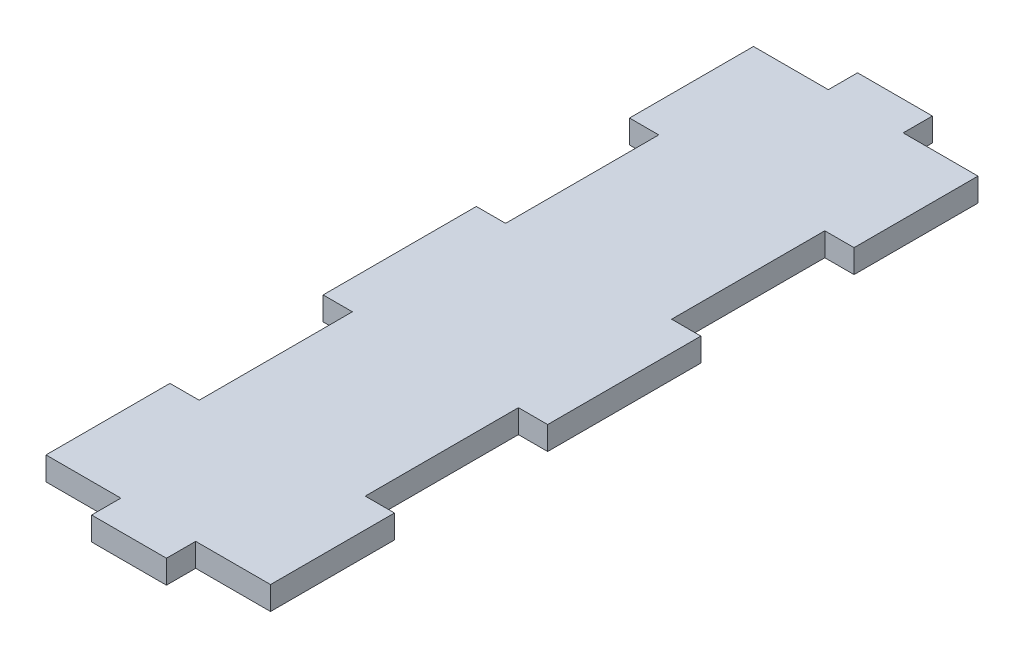
ISO-10303-21;
HEADER;
FILE_DESCRIPTION(('STEP AP214'),'2;1');
FILE_NAME('part.step','',(''),(''),'','','');
FILE_SCHEMA(('AUTOMOTIVE_DESIGN { 1 0 10303 214 1 1 1 1 }'));
ENDSEC;
DATA;
#1=APPLICATION_CONTEXT('core data for automotive mechanical design processes');
#2=APPLICATION_PROTOCOL_DEFINITION('international standard','automotive_design',2000,#1);
#3=PRODUCT_CONTEXT('',#1,'mechanical');
#4=PRODUCT('Part','Part','',(#3));
#5=PRODUCT_RELATED_PRODUCT_CATEGORY('part','',(#4));
#6=PRODUCT_DEFINITION_FORMATION('','',#4);
#7=PRODUCT_DEFINITION_CONTEXT('part definition',#1,'design');
#8=PRODUCT_DEFINITION('design','',#6,#7);
#9=PRODUCT_DEFINITION_SHAPE('','',#8);
#10=(LENGTH_UNIT() NAMED_UNIT(*) SI_UNIT(.MILLI.,.METRE.));
#11=(NAMED_UNIT(*) PLANE_ANGLE_UNIT() SI_UNIT($,.RADIAN.));
#12=(NAMED_UNIT(*) SI_UNIT($,.STERADIAN.) SOLID_ANGLE_UNIT());
#13=UNCERTAINTY_MEASURE_WITH_UNIT(LENGTH_MEASURE(1.E-05),#10,'distance_accuracy_value','');
#14=(GEOMETRIC_REPRESENTATION_CONTEXT(3) GLOBAL_UNCERTAINTY_ASSIGNED_CONTEXT((#13)) GLOBAL_UNIT_ASSIGNED_CONTEXT((#10,
#11,#12)) REPRESENTATION_CONTEXT('',''));
#15=CARTESIAN_POINT('',(0.,0.,0.));
#16=DIRECTION('',(0.,0.,1.));
#17=DIRECTION('',(1.,0.,0.));
#18=AXIS2_PLACEMENT_3D('',#15,#16,#17);
#19=CARTESIAN_POINT('',(12.192,2.54,41.5925));
#20=DIRECTION('',(-1.,0.,0.));
#21=DIRECTION('',(0.,0.,1.));
#22=AXIS2_PLACEMENT_3D('',#19,#20,#21);
#23=PLANE('',#22);
#24=DIRECTION('',(0.,0.,-1.));
#25=VECTOR('',#24,1.);
#26=CARTESIAN_POINT('',(12.192,2.54,41.5925));
#27=LINE('',#26,#25);
#28=CARTESIAN_POINT('',(12.192,2.54,38.4175));
#29=VERTEX_POINT('',#28);
#30=CARTESIAN_POINT('',(12.192,2.54,24.9555));
#31=VERTEX_POINT('',#30);
#32=EDGE_CURVE('E251',#29,#31,#27,.T.);
#33=ORIENTED_EDGE('',*,*,#32,.F.);
#34=DIRECTION('',(0.,1.,0.));
#35=VECTOR('',#34,1.);
#36=CARTESIAN_POINT('',(12.192,-0.635,38.4175));
#37=LINE('',#36,#35);
#38=CARTESIAN_POINT('',(12.192,0.,38.4175));
#39=VERTEX_POINT('',#38);
#40=EDGE_CURVE('E364',#39,#29,#37,.T.);
#41=ORIENTED_EDGE('',*,*,#40,.F.);
#42=DIRECTION('',(0.,0.,-1.));
#43=VECTOR('',#42,1.);
#44=CARTESIAN_POINT('',(12.192,0.,41.5925));
#45=LINE('',#44,#43);
#46=CARTESIAN_POINT('',(12.192,0.,24.9555));
#47=VERTEX_POINT('',#46);
#48=EDGE_CURVE('E413',#39,#47,#45,.T.);
#49=ORIENTED_EDGE('',*,*,#48,.T.);
#50=DIRECTION('',(0.,1.,0.));
#51=VECTOR('',#50,1.);
#52=CARTESIAN_POINT('',(12.192,0.,24.9555));
#53=LINE('',#52,#51);
#54=EDGE_CURVE('E318',#47,#31,#53,.T.);
#55=ORIENTED_EDGE('',*,*,#54,.T.);
#56=EDGE_LOOP('',(#33,#41,#49,#55));
#57=FACE_BOUND('',#56,.T.);
#58=ADVANCED_FACE('F33',(#57),#23,.F.);
#59=CARTESIAN_POINT('',(-12.192,2.54,41.5925));
#60=DIRECTION('',(1.,0.,0.));
#61=DIRECTION('',(0.,0.,-1.));
#62=AXIS2_PLACEMENT_3D('',#59,#60,#61);
#63=PLANE('',#62);
#64=DIRECTION('',(0.,0.,1.));
#65=VECTOR('',#64,1.);
#66=CARTESIAN_POINT('',(-12.192,0.,41.5925));
#67=LINE('',#66,#65);
#68=CARTESIAN_POINT('',(-12.192,0.,24.9555));
#69=VERTEX_POINT('',#68);
#70=CARTESIAN_POINT('',(-12.192,0.,38.4175));
#71=VERTEX_POINT('',#70);
#72=EDGE_CURVE('E412',#69,#71,#67,.T.);
#73=ORIENTED_EDGE('',*,*,#72,.T.);
#74=DIRECTION('',(0.,1.,0.));
#75=VECTOR('',#74,1.);
#76=CARTESIAN_POINT('',(-12.192,-0.635,38.4175));
#77=LINE('',#76,#75);
#78=CARTESIAN_POINT('',(-12.192,2.54,38.4175));
#79=VERTEX_POINT('',#78);
#80=EDGE_CURVE('E55',#71,#79,#77,.T.);
#81=ORIENTED_EDGE('',*,*,#80,.T.);
#82=DIRECTION('',(0.,0.,1.));
#83=VECTOR('',#82,1.);
#84=CARTESIAN_POINT('',(-12.192,2.54,41.5925));
#85=LINE('',#84,#83);
#86=CARTESIAN_POINT('',(-12.192,2.54,24.9555));
#87=VERTEX_POINT('',#86);
#88=EDGE_CURVE('E241',#87,#79,#85,.T.);
#89=ORIENTED_EDGE('',*,*,#88,.F.);
#90=DIRECTION('',(0.,1.,0.));
#91=VECTOR('',#90,1.);
#92=CARTESIAN_POINT('',(-12.192,0.,24.9555));
#93=LINE('',#92,#91);
#94=EDGE_CURVE('E346',#69,#87,#93,.T.);
#95=ORIENTED_EDGE('',*,*,#94,.F.);
#96=EDGE_LOOP('',(#73,#81,#89,#95));
#97=FACE_BOUND('',#96,.T.);
#98=ADVANCED_FACE('F457',(#97),#63,.F.);
#99=CARTESIAN_POINT('',(12.192,2.54,8.3185));
#100=VERTEX_POINT('',#99);
#101=CARTESIAN_POINT('',(12.192,2.54,-8.3185));
#102=VERTEX_POINT('',#101);
#103=EDGE_CURVE('E254',#100,#102,#27,.T.);
#104=ORIENTED_EDGE('',*,*,#103,.F.);
#105=DIRECTION('',(0.,1.,0.));
#106=VECTOR('',#105,1.);
#107=CARTESIAN_POINT('',(12.192,0.,8.3185));
#108=LINE('',#107,#106);
#109=CARTESIAN_POINT('',(12.192,0.,8.3185));
#110=VERTEX_POINT('',#109);
#111=EDGE_CURVE('E311',#110,#100,#108,.T.);
#112=ORIENTED_EDGE('',*,*,#111,.F.);
#113=CARTESIAN_POINT('',(12.192,0.,-8.3185));
#114=VERTEX_POINT('',#113);
#115=EDGE_CURVE('E419',#110,#114,#45,.T.);
#116=ORIENTED_EDGE('',*,*,#115,.T.);
#117=DIRECTION('',(0.,1.,0.));
#118=VECTOR('',#117,1.);
#119=CARTESIAN_POINT('',(12.192,0.,-8.3185));
#120=LINE('',#119,#118);
#121=EDGE_CURVE('E265',#114,#102,#120,.T.);
#122=ORIENTED_EDGE('',*,*,#121,.T.);
#123=EDGE_LOOP('',(#104,#112,#116,#122));
#124=FACE_BOUND('',#123,.T.);
#125=ADVANCED_FACE('F500',(#124),#23,.F.);
#126=CARTESIAN_POINT('',(-12.192,0.,-8.3185));
#127=VERTEX_POINT('',#126);
#128=CARTESIAN_POINT('',(-12.192,0.,8.3185));
#129=VERTEX_POINT('',#128);
#130=EDGE_CURVE('E416',#127,#129,#67,.T.);
#131=ORIENTED_EDGE('',*,*,#130,.T.);
#132=DIRECTION('',(0.,1.,0.));
#133=VECTOR('',#132,1.);
#134=CARTESIAN_POINT('',(-12.192,0.,8.3185));
#135=LINE('',#134,#133);
#136=CARTESIAN_POINT('',(-12.192,2.54,8.3185));
#137=VERTEX_POINT('',#136);
#138=EDGE_CURVE('E342',#129,#137,#135,.T.);
#139=ORIENTED_EDGE('',*,*,#138,.T.);
#140=CARTESIAN_POINT('',(-12.192,2.54,-8.3185));
#141=VERTEX_POINT('',#140);
#142=EDGE_CURVE('E239',#141,#137,#85,.T.);
#143=ORIENTED_EDGE('',*,*,#142,.F.);
#144=DIRECTION('',(0.,1.,0.));
#145=VECTOR('',#144,1.);
#146=CARTESIAN_POINT('',(-12.192,0.,-8.3185));
#147=LINE('',#146,#145);
#148=EDGE_CURVE('E291',#127,#141,#147,.T.);
#149=ORIENTED_EDGE('',*,*,#148,.F.);
#150=EDGE_LOOP('',(#131,#139,#143,#149));
#151=FACE_BOUND('',#150,.T.);
#152=ADVANCED_FACE('F474',(#151),#63,.F.);
#153=CARTESIAN_POINT('',(12.192,0.,-24.9555));
#154=VERTEX_POINT('',#153);
#155=CARTESIAN_POINT('',(12.192,0.,-38.4175));
#156=VERTEX_POINT('',#155);
#157=EDGE_CURVE('E295',#154,#156,#45,.T.);
#158=ORIENTED_EDGE('',*,*,#157,.T.);
#159=DIRECTION('',(0.,1.,0.));
#160=VECTOR('',#159,1.);
#161=CARTESIAN_POINT('',(12.192,-0.635,-38.4175));
#162=LINE('',#161,#160);
#163=CARTESIAN_POINT('',(12.192,2.54,-38.4175));
#164=VERTEX_POINT('',#163);
#165=EDGE_CURVE('E381',#156,#164,#162,.T.);
#166=ORIENTED_EDGE('',*,*,#165,.T.);
#167=CARTESIAN_POINT('',(12.192,2.54,-24.9555));
#168=VERTEX_POINT('',#167);
#169=EDGE_CURVE('E256',#168,#164,#27,.T.);
#170=ORIENTED_EDGE('',*,*,#169,.F.);
#171=DIRECTION('',(0.,1.,0.));
#172=VECTOR('',#171,1.);
#173=CARTESIAN_POINT('',(12.192,0.,-24.9555));
#174=LINE('',#173,#172);
#175=EDGE_CURVE('E258',#154,#168,#174,.T.);
#176=ORIENTED_EDGE('',*,*,#175,.F.);
#177=EDGE_LOOP('',(#158,#166,#170,#176));
#178=FACE_BOUND('',#177,.T.);
#179=ADVANCED_FACE('F35',(#178),#23,.F.);
#180=CARTESIAN_POINT('',(-12.192,2.54,-41.5925));
#181=DIRECTION('',(0.,0.,1.));
#182=DIRECTION('',(1.,0.,0.));
#183=AXIS2_PLACEMENT_3D('',#180,#181,#182);
#184=PLANE('',#183);
#185=DIRECTION('',(-1.,0.,0.));
#186=VECTOR('',#185,1.);
#187=CARTESIAN_POINT('',(-12.192,0.,-41.5925));
#188=LINE('',#187,#186);
#189=CARTESIAN_POINT('',(4.064,0.,-41.5925));
#190=VERTEX_POINT('',#189);
#191=CARTESIAN_POINT('',(-4.064,0.,-41.5925));
#192=VERTEX_POINT('',#191);
#193=EDGE_CURVE('E409',#190,#192,#188,.T.);
#194=ORIENTED_EDGE('',*,*,#193,.T.);
#195=DIRECTION('',(0.,1.,0.));
#196=VECTOR('',#195,1.);
#197=CARTESIAN_POINT('',(-4.064,-0.635,-41.5925));
#198=LINE('',#197,#196);
#199=CARTESIAN_POINT('',(-4.064,2.54,-41.5925));
#200=VERTEX_POINT('',#199);
#201=EDGE_CURVE('E378',#192,#200,#198,.T.);
#202=ORIENTED_EDGE('',*,*,#201,.T.);
#203=DIRECTION('',(-1.,0.,0.));
#204=VECTOR('',#203,1.);
#205=CARTESIAN_POINT('',(-12.192,2.54,-41.5925));
#206=LINE('',#205,#204);
#207=CARTESIAN_POINT('',(4.064,2.54,-41.5925));
#208=VERTEX_POINT('',#207);
#209=EDGE_CURVE('E247',#208,#200,#206,.T.);
#210=ORIENTED_EDGE('',*,*,#209,.F.);
#211=DIRECTION('',(0.,1.,0.));
#212=VECTOR('',#211,1.);
#213=CARTESIAN_POINT('',(4.064,-0.635,-41.5925));
#214=LINE('',#213,#212);
#215=EDGE_CURVE('E332',#190,#208,#214,.T.);
#216=ORIENTED_EDGE('',*,*,#215,.F.);
#217=EDGE_LOOP('',(#194,#202,#210,#216));
#218=FACE_BOUND('',#217,.T.);
#219=ADVANCED_FACE('F406',(#218),#184,.F.);
#220=CARTESIAN_POINT('',(-12.192,2.54,-38.4175));
#221=VERTEX_POINT('',#220);
#222=CARTESIAN_POINT('',(-12.192,2.54,-24.9555));
#223=VERTEX_POINT('',#222);
#224=EDGE_CURVE('E230',#221,#223,#85,.T.);
#225=ORIENTED_EDGE('',*,*,#224,.F.);
#226=DIRECTION('',(0.,1.,0.));
#227=VECTOR('',#226,1.);
#228=CARTESIAN_POINT('',(-12.192,-0.635,-38.4175));
#229=LINE('',#228,#227);
#230=CARTESIAN_POINT('',(-12.192,0.,-38.4175));
#231=VERTEX_POINT('',#230);
#232=EDGE_CURVE('E215',#231,#221,#229,.T.);
#233=ORIENTED_EDGE('',*,*,#232,.F.);
#234=CARTESIAN_POINT('',(-12.192,0.,-24.9555));
#235=VERTEX_POINT('',#234);
#236=EDGE_CURVE('E418',#231,#235,#67,.T.);
#237=ORIENTED_EDGE('',*,*,#236,.T.);
#238=DIRECTION('',(0.,1.,0.));
#239=VECTOR('',#238,1.);
#240=CARTESIAN_POINT('',(-12.192,0.,-24.9555));
#241=LINE('',#240,#239);
#242=EDGE_CURVE('E237',#235,#223,#241,.T.);
#243=ORIENTED_EDGE('',*,*,#242,.T.);
#244=EDGE_LOOP('',(#225,#233,#237,#243));
#245=FACE_BOUND('',#244,.T.);
#246=ADVANCED_FACE('F235',(#245),#63,.F.);
#247=CARTESIAN_POINT('',(-12.192,2.54,41.5925));
#248=DIRECTION('',(0.,0.,-1.));
#249=DIRECTION('',(-1.,0.,0.));
#250=AXIS2_PLACEMENT_3D('',#247,#248,#249);
#251=PLANE('',#250);
#252=DIRECTION('',(1.,0.,0.));
#253=VECTOR('',#252,1.);
#254=CARTESIAN_POINT('',(-12.192,2.54,41.5925));
#255=LINE('',#254,#253);
#256=CARTESIAN_POINT('',(-4.064,2.54,41.5925));
#257=VERTEX_POINT('',#256);
#258=CARTESIAN_POINT('',(4.064,2.54,41.5925));
#259=VERTEX_POINT('',#258);
#260=EDGE_CURVE('E238',#257,#259,#255,.T.);
#261=ORIENTED_EDGE('',*,*,#260,.F.);
#262=DIRECTION('',(0.,1.,0.));
#263=VECTOR('',#262,1.);
#264=CARTESIAN_POINT('',(-4.064,-0.635,41.5925));
#265=LINE('',#264,#263);
#266=CARTESIAN_POINT('',(-4.064,0.,41.5925));
#267=VERTEX_POINT('',#266);
#268=EDGE_CURVE('E232',#267,#257,#265,.T.);
#269=ORIENTED_EDGE('',*,*,#268,.F.);
#270=DIRECTION('',(1.,0.,0.));
#271=VECTOR('',#270,1.);
#272=CARTESIAN_POINT('',(-12.192,0.,41.5925));
#273=LINE('',#272,#271);
#274=CARTESIAN_POINT('',(4.064,0.,41.5925));
#275=VERTEX_POINT('',#274);
#276=EDGE_CURVE('E422',#267,#275,#273,.T.);
#277=ORIENTED_EDGE('',*,*,#276,.T.);
#278=DIRECTION('',(0.,1.,0.));
#279=VECTOR('',#278,1.);
#280=CARTESIAN_POINT('',(4.064,-0.635,41.5925));
#281=LINE('',#280,#279);
#282=EDGE_CURVE('E369',#275,#259,#281,.T.);
#283=ORIENTED_EDGE('',*,*,#282,.T.);
#284=EDGE_LOOP('',(#261,#269,#277,#283));
#285=FACE_BOUND('',#284,.T.);
#286=ADVANCED_FACE('F444',(#285),#251,.F.);
#287=CARTESIAN_POINT('',(0.,2.54,0.));
#288=DIRECTION('',(0.,-1.,0.));
#289=DIRECTION('',(0.,0.,-1.));
#290=AXIS2_PLACEMENT_3D('',#287,#288,#289);
#291=PLANE('',#290);
#292=ORIENTED_EDGE('',*,*,#209,.T.);
#293=DIRECTION('',(0.,0.,-1.));
#294=VECTOR('',#293,1.);
#295=CARTESIAN_POINT('',(-4.064,2.54,-38.4175));
#296=LINE('',#295,#294);
#297=CARTESIAN_POINT('',(-4.064,2.54,-38.4175));
#298=VERTEX_POINT('',#297);
#299=EDGE_CURVE('E224',#298,#200,#296,.T.);
#300=ORIENTED_EDGE('',*,*,#299,.F.);
#301=DIRECTION('',(1.,0.,0.));
#302=VECTOR('',#301,1.);
#303=CARTESIAN_POINT('',(-12.192,2.54,-38.4175));
#304=LINE('',#303,#302);
#305=EDGE_CURVE('E218',#221,#298,#304,.T.);
#306=ORIENTED_EDGE('',*,*,#305,.F.);
#307=ORIENTED_EDGE('',*,*,#224,.T.);
#308=DIRECTION('',(-1.,0.,0.));
#309=VECTOR('',#308,1.);
#310=CARTESIAN_POINT('',(-9.01700000000001,2.54,-24.9555));
#311=LINE('',#310,#309);
#312=CARTESIAN_POINT('',(-9.01700000000001,2.54,-24.9555));
#313=VERTEX_POINT('',#312);
#314=EDGE_CURVE('E300',#313,#223,#311,.T.);
#315=ORIENTED_EDGE('',*,*,#314,.F.);
#316=DIRECTION('',(0.,0.,-1.));
#317=VECTOR('',#316,1.);
#318=CARTESIAN_POINT('',(-9.01700000000001,2.54,-8.3185));
#319=LINE('',#318,#317);
#320=CARTESIAN_POINT('',(-9.01700000000001,2.54,-8.3185));
#321=VERTEX_POINT('',#320);
#322=EDGE_CURVE('E268',#321,#313,#319,.T.);
#323=ORIENTED_EDGE('',*,*,#322,.F.);
#324=DIRECTION('',(1.,0.,0.));
#325=VECTOR('',#324,1.);
#326=CARTESIAN_POINT('',(-9.01700000000001,2.54,-8.3185));
#327=LINE('',#326,#325);
#328=EDGE_CURVE('E296',#141,#321,#327,.T.);
#329=ORIENTED_EDGE('',*,*,#328,.F.);
#330=ORIENTED_EDGE('',*,*,#142,.T.);
#331=DIRECTION('',(-1.,0.,0.));
#332=VECTOR('',#331,1.);
#333=CARTESIAN_POINT('',(-9.01700000000001,2.54,8.3185));
#334=LINE('',#333,#332);
#335=CARTESIAN_POINT('',(-9.01700000000001,2.54,8.3185));
#336=VERTEX_POINT('',#335);
#337=EDGE_CURVE('E353',#336,#137,#334,.T.);
#338=ORIENTED_EDGE('',*,*,#337,.F.);
#339=DIRECTION('',(0.,0.,-1.));
#340=VECTOR('',#339,1.);
#341=CARTESIAN_POINT('',(-9.01700000000001,2.54,24.9555));
#342=LINE('',#341,#340);
#343=CARTESIAN_POINT('',(-9.01700000000001,2.54,24.9555));
#344=VERTEX_POINT('',#343);
#345=EDGE_CURVE('E321',#344,#336,#342,.T.);
#346=ORIENTED_EDGE('',*,*,#345,.F.);
#347=DIRECTION('',(1.,0.,0.));
#348=VECTOR('',#347,1.);
#349=CARTESIAN_POINT('',(-9.01700000000001,2.54,24.9555));
#350=LINE('',#349,#348);
#351=EDGE_CURVE('E349',#87,#344,#350,.T.);
#352=ORIENTED_EDGE('',*,*,#351,.F.);
#353=ORIENTED_EDGE('',*,*,#88,.T.);
#354=DIRECTION('',(-1.,0.,0.));
#355=VECTOR('',#354,1.);
#356=CARTESIAN_POINT('',(-4.064,2.54,38.4175));
#357=LINE('',#356,#355);
#358=CARTESIAN_POINT('',(-4.064,2.54,38.4175));
#359=VERTEX_POINT('',#358);
#360=EDGE_CURVE('E391',#359,#79,#357,.T.);
#361=ORIENTED_EDGE('',*,*,#360,.F.);
#362=DIRECTION('',(0.,0.,-1.));
#363=VECTOR('',#362,1.);
#364=CARTESIAN_POINT('',(-4.064,2.54,41.5925));
#365=LINE('',#364,#363);
#366=EDGE_CURVE('E395',#257,#359,#365,.T.);
#367=ORIENTED_EDGE('',*,*,#366,.F.);
#368=ORIENTED_EDGE('',*,*,#260,.T.);
#369=DIRECTION('',(0.,0.,1.));
#370=VECTOR('',#369,1.);
#371=CARTESIAN_POINT('',(4.064,2.54,41.5925));
#372=LINE('',#371,#370);
#373=CARTESIAN_POINT('',(4.064,2.54,38.4175));
#374=VERTEX_POINT('',#373);
#375=EDGE_CURVE('E367',#374,#259,#372,.T.);
#376=ORIENTED_EDGE('',*,*,#375,.F.);
#377=DIRECTION('',(-1.,0.,0.));
#378=VECTOR('',#377,1.);
#379=CARTESIAN_POINT('',(12.192,2.54,38.4175));
#380=LINE('',#379,#378);
#381=EDGE_CURVE('E375',#29,#374,#380,.T.);
#382=ORIENTED_EDGE('',*,*,#381,.F.);
#383=ORIENTED_EDGE('',*,*,#32,.T.);
#384=DIRECTION('',(1.,0.,0.));
#385=VECTOR('',#384,1.);
#386=CARTESIAN_POINT('',(12.192,2.54,24.9555));
#387=LINE('',#386,#385);
#388=CARTESIAN_POINT('',(9.017,2.54,24.9555));
#389=VERTEX_POINT('',#388);
#390=EDGE_CURVE('E322',#389,#31,#387,.T.);
#391=ORIENTED_EDGE('',*,*,#390,.F.);
#392=DIRECTION('',(0.,0.,1.));
#393=VECTOR('',#392,1.);
#394=CARTESIAN_POINT('',(9.017,2.54,24.9555));
#395=LINE('',#394,#393);
#396=CARTESIAN_POINT('',(9.017,2.54,8.3185));
#397=VERTEX_POINT('',#396);
#398=EDGE_CURVE('E326',#397,#389,#395,.T.);
#399=ORIENTED_EDGE('',*,*,#398,.F.);
#400=DIRECTION('',(-1.,0.,0.));
#401=VECTOR('',#400,1.);
#402=CARTESIAN_POINT('',(12.192,2.54,8.3185));
#403=LINE('',#402,#401);
#404=EDGE_CURVE('E329',#100,#397,#403,.T.);
#405=ORIENTED_EDGE('',*,*,#404,.F.);
#406=ORIENTED_EDGE('',*,*,#103,.T.);
#407=DIRECTION('',(1.,0.,0.));
#408=VECTOR('',#407,1.);
#409=CARTESIAN_POINT('',(12.192,2.54,-8.3185));
#410=LINE('',#409,#408);
#411=CARTESIAN_POINT('',(9.017,2.54,-8.3185));
#412=VERTEX_POINT('',#411);
#413=EDGE_CURVE('E269',#412,#102,#410,.T.);
#414=ORIENTED_EDGE('',*,*,#413,.F.);
#415=DIRECTION('',(0.,0.,1.));
#416=VECTOR('',#415,1.);
#417=CARTESIAN_POINT('',(9.017,2.54,-8.3185));
#418=LINE('',#417,#416);
#419=CARTESIAN_POINT('',(9.017,2.54,-24.9555));
#420=VERTEX_POINT('',#419);
#421=EDGE_CURVE('E273',#420,#412,#418,.T.);
#422=ORIENTED_EDGE('',*,*,#421,.F.);
#423=DIRECTION('',(-1.,0.,0.));
#424=VECTOR('',#423,1.);
#425=CARTESIAN_POINT('',(12.192,2.54,-24.9555));
#426=LINE('',#425,#424);
#427=EDGE_CURVE('E276',#168,#420,#426,.T.);
#428=ORIENTED_EDGE('',*,*,#427,.F.);
#429=ORIENTED_EDGE('',*,*,#169,.T.);
#430=DIRECTION('',(1.,0.,0.));
#431=VECTOR('',#430,1.);
#432=CARTESIAN_POINT('',(4.064,2.54,-38.4175));
#433=LINE('',#432,#431);
#434=CARTESIAN_POINT('',(4.064,2.54,-38.4175));
#435=VERTEX_POINT('',#434);
#436=EDGE_CURVE('E382',#435,#164,#433,.T.);
#437=ORIENTED_EDGE('',*,*,#436,.F.);
#438=DIRECTION('',(0.,0.,1.));
#439=VECTOR('',#438,1.);
#440=CARTESIAN_POINT('',(4.064,2.54,-38.4175));
#441=LINE('',#440,#439);
#442=EDGE_CURVE('E372',#208,#435,#441,.T.);
#443=ORIENTED_EDGE('',*,*,#442,.F.);
#444=EDGE_LOOP('',(#292,#300,#306,#307,#315,#323,#329,#330,#338,#346,#352,#353,#361,#367,#368,
#376,#382,#383,#391,#399,#405,#406,#414,#422,#428,#429,#437,#443));
#445=FACE_BOUND('',#444,.T.);
#446=ADVANCED_FACE('F228',(#445),#291,.F.);
#447=CARTESIAN_POINT('',(0.,0.,0.));
#448=DIRECTION('',(0.,-1.,0.));
#449=DIRECTION('',(0.,0.,-1.));
#450=AXIS2_PLACEMENT_3D('',#447,#448,#449);
#451=PLANE('',#450);
#452=DIRECTION('',(0.,0.,1.));
#453=VECTOR('',#452,1.);
#454=CARTESIAN_POINT('',(-4.064,0.,0.));
#455=LINE('',#454,#453);
#456=CARTESIAN_POINT('',(-4.064,0.,-38.4175));
#457=VERTEX_POINT('',#456);
#458=EDGE_CURVE('E11',#192,#457,#455,.T.);
#459=ORIENTED_EDGE('',*,*,#458,.F.);
#460=ORIENTED_EDGE('',*,*,#193,.F.);
#461=DIRECTION('',(0.,0.,-1.));
#462=VECTOR('',#461,1.);
#463=CARTESIAN_POINT('',(4.064,0.,0.));
#464=LINE('',#463,#462);
#465=CARTESIAN_POINT('',(4.064,0.,-38.4175));
#466=VERTEX_POINT('',#465);
#467=EDGE_CURVE('E430',#466,#190,#464,.T.);
#468=ORIENTED_EDGE('',*,*,#467,.F.);
#469=DIRECTION('',(-1.,0.,0.));
#470=VECTOR('',#469,1.);
#471=CARTESIAN_POINT('',(0.,0.,-38.4175));
#472=LINE('',#471,#470);
#473=EDGE_CURVE('E428',#156,#466,#472,.T.);
#474=ORIENTED_EDGE('',*,*,#473,.F.);
#475=ORIENTED_EDGE('',*,*,#157,.F.);
#476=DIRECTION('',(-1.,0.,0.));
#477=VECTOR('',#476,1.);
#478=CARTESIAN_POINT('',(12.192,0.,-24.9555));
#479=LINE('',#478,#477);
#480=CARTESIAN_POINT('',(9.017,0.,-24.9555));
#481=VERTEX_POINT('',#480);
#482=EDGE_CURVE('E272',#154,#481,#479,.T.);
#483=ORIENTED_EDGE('',*,*,#482,.T.);
#484=DIRECTION('',(0.,0.,1.));
#485=VECTOR('',#484,1.);
#486=CARTESIAN_POINT('',(9.017,0.,-8.3185));
#487=LINE('',#486,#485);
#488=CARTESIAN_POINT('',(9.017,0.,-8.3185));
#489=VERTEX_POINT('',#488);
#490=EDGE_CURVE('E282',#481,#489,#487,.T.);
#491=ORIENTED_EDGE('',*,*,#490,.T.);
#492=DIRECTION('',(1.,0.,0.));
#493=VECTOR('',#492,1.);
#494=CARTESIAN_POINT('',(12.192,0.,-8.3185));
#495=LINE('',#494,#493);
#496=EDGE_CURVE('E261',#489,#114,#495,.T.);
#497=ORIENTED_EDGE('',*,*,#496,.T.);
#498=ORIENTED_EDGE('',*,*,#115,.F.);
#499=DIRECTION('',(-1.,0.,0.));
#500=VECTOR('',#499,1.);
#501=CARTESIAN_POINT('',(12.192,0.,8.3185));
#502=LINE('',#501,#500);
#503=CARTESIAN_POINT('',(9.017,0.,8.3185));
#504=VERTEX_POINT('',#503);
#505=EDGE_CURVE('E325',#110,#504,#502,.T.);
#506=ORIENTED_EDGE('',*,*,#505,.T.);
#507=DIRECTION('',(0.,0.,1.));
#508=VECTOR('',#507,1.);
#509=CARTESIAN_POINT('',(9.017,0.,24.9555));
#510=LINE('',#509,#508);
#511=CARTESIAN_POINT('',(9.017,0.,24.9555));
#512=VERTEX_POINT('',#511);
#513=EDGE_CURVE('E335',#504,#512,#510,.T.);
#514=ORIENTED_EDGE('',*,*,#513,.T.);
#515=DIRECTION('',(1.,0.,0.));
#516=VECTOR('',#515,1.);
#517=CARTESIAN_POINT('',(12.192,0.,24.9555));
#518=LINE('',#517,#516);
#519=EDGE_CURVE('E314',#512,#47,#518,.T.);
#520=ORIENTED_EDGE('',*,*,#519,.T.);
#521=ORIENTED_EDGE('',*,*,#48,.F.);
#522=DIRECTION('',(1.,0.,0.));
#523=VECTOR('',#522,1.);
#524=CARTESIAN_POINT('',(0.,0.,38.4175));
#525=LINE('',#524,#523);
#526=CARTESIAN_POINT('',(4.064,0.,38.4175));
#527=VERTEX_POINT('',#526);
#528=EDGE_CURVE('E242',#527,#39,#525,.T.);
#529=ORIENTED_EDGE('',*,*,#528,.F.);
#530=DIRECTION('',(0.,0.,-1.));
#531=VECTOR('',#530,1.);
#532=CARTESIAN_POINT('',(4.064,0.,0.));
#533=LINE('',#532,#531);
#534=EDGE_CURVE('E425',#275,#527,#533,.T.);
#535=ORIENTED_EDGE('',*,*,#534,.F.);
#536=ORIENTED_EDGE('',*,*,#276,.F.);
#537=DIRECTION('',(0.,0.,1.));
#538=VECTOR('',#537,1.);
#539=CARTESIAN_POINT('',(-4.064,0.,0.));
#540=LINE('',#539,#538);
#541=CARTESIAN_POINT('',(-4.064,0.,38.4175));
#542=VERTEX_POINT('',#541);
#543=EDGE_CURVE('E434',#542,#267,#540,.T.);
#544=ORIENTED_EDGE('',*,*,#543,.F.);
#545=DIRECTION('',(1.,0.,0.));
#546=VECTOR('',#545,1.);
#547=CARTESIAN_POINT('',(0.,0.,38.4175));
#548=LINE('',#547,#546);
#549=EDGE_CURVE('E432',#71,#542,#548,.T.);
#550=ORIENTED_EDGE('',*,*,#549,.F.);
#551=ORIENTED_EDGE('',*,*,#72,.F.);
#552=DIRECTION('',(1.,0.,0.));
#553=VECTOR('',#552,1.);
#554=CARTESIAN_POINT('',(-9.01700000000001,0.,24.9555));
#555=LINE('',#554,#553);
#556=CARTESIAN_POINT('',(-9.01700000000001,0.,24.9555));
#557=VERTEX_POINT('',#556);
#558=EDGE_CURVE('E343',#69,#557,#555,.T.);
#559=ORIENTED_EDGE('',*,*,#558,.T.);
#560=DIRECTION('',(0.,0.,-1.));
#561=VECTOR('',#560,1.);
#562=CARTESIAN_POINT('',(-9.01700000000001,0.,24.9555));
#563=LINE('',#562,#561);
#564=CARTESIAN_POINT('',(-9.01700000000001,0.,8.3185));
#565=VERTEX_POINT('',#564);
#566=EDGE_CURVE('E352',#557,#565,#563,.T.);
#567=ORIENTED_EDGE('',*,*,#566,.T.);
#568=DIRECTION('',(-1.,0.,0.));
#569=VECTOR('',#568,1.);
#570=CARTESIAN_POINT('',(-9.01700000000001,0.,8.3185));
#571=LINE('',#570,#569);
#572=EDGE_CURVE('E359',#565,#129,#571,.T.);
#573=ORIENTED_EDGE('',*,*,#572,.T.);
#574=ORIENTED_EDGE('',*,*,#130,.F.);
#575=DIRECTION('',(1.,0.,0.));
#576=VECTOR('',#575,1.);
#577=CARTESIAN_POINT('',(-9.01700000000001,0.,-8.3185));
#578=LINE('',#577,#576);
#579=CARTESIAN_POINT('',(-9.01700000000001,0.,-8.3185));
#580=VERTEX_POINT('',#579);
#581=EDGE_CURVE('E289',#127,#580,#578,.T.);
#582=ORIENTED_EDGE('',*,*,#581,.T.);
#583=DIRECTION('',(0.,0.,-1.));
#584=VECTOR('',#583,1.);
#585=CARTESIAN_POINT('',(-9.01700000000001,0.,-8.3185));
#586=LINE('',#585,#584);
#587=CARTESIAN_POINT('',(-9.01700000000001,0.,-24.9555));
#588=VERTEX_POINT('',#587);
#589=EDGE_CURVE('E299',#580,#588,#586,.T.);
#590=ORIENTED_EDGE('',*,*,#589,.T.);
#591=DIRECTION('',(-1.,0.,0.));
#592=VECTOR('',#591,1.);
#593=CARTESIAN_POINT('',(-9.01700000000001,0.,-24.9555));
#594=LINE('',#593,#592);
#595=EDGE_CURVE('E306',#588,#235,#594,.T.);
#596=ORIENTED_EDGE('',*,*,#595,.T.);
#597=ORIENTED_EDGE('',*,*,#236,.F.);
#598=DIRECTION('',(-1.,0.,0.));
#599=VECTOR('',#598,1.);
#600=CARTESIAN_POINT('',(0.,0.,-38.4175));
#601=LINE('',#600,#599);
#602=EDGE_CURVE('E41',#457,#231,#601,.T.);
#603=ORIENTED_EDGE('',*,*,#602,.F.);
#604=EDGE_LOOP('',(#459,#460,#468,#474,#475,#483,#491,#497,#498,#506,#514,#520,#521,#529,#535,
#536,#544,#550,#551,#559,#567,#573,#574,#582,#590,#596,#597,#603));
#605=FACE_BOUND('',#604,.T.);
#606=ADVANCED_FACE('F447',(#605),#451,.T.);
#607=CARTESIAN_POINT('',(12.192,0.,-8.3185));
#608=DIRECTION('',(0.,0.,1.));
#609=DIRECTION('',(1.,0.,0.));
#610=AXIS2_PLACEMENT_3D('',#607,#608,#609);
#611=PLANE('',#610);
#612=ORIENTED_EDGE('',*,*,#413,.T.);
#613=ORIENTED_EDGE('',*,*,#121,.F.);
#614=ORIENTED_EDGE('',*,*,#496,.F.);
#615=DIRECTION('',(0.,1.,0.));
#616=VECTOR('',#615,1.);
#617=CARTESIAN_POINT('',(9.017,0.,-8.3185));
#618=LINE('',#617,#616);
#619=EDGE_CURVE('E263',#489,#412,#618,.T.);
#620=ORIENTED_EDGE('',*,*,#619,.T.);
#621=EDGE_LOOP('',(#612,#613,#614,#620));
#622=FACE_BOUND('',#621,.T.);
#623=ADVANCED_FACE('F525',(#622),#611,.F.);
#624=CARTESIAN_POINT('',(9.017,0.,-8.3185));
#625=DIRECTION('',(-1.,0.,0.));
#626=DIRECTION('',(0.,0.,1.));
#627=AXIS2_PLACEMENT_3D('',#624,#625,#626);
#628=PLANE('',#627);
#629=ORIENTED_EDGE('',*,*,#421,.T.);
#630=ORIENTED_EDGE('',*,*,#619,.F.);
#631=ORIENTED_EDGE('',*,*,#490,.F.);
#632=DIRECTION('',(0.,1.,0.));
#633=VECTOR('',#632,1.);
#634=CARTESIAN_POINT('',(9.017,0.,-24.9555));
#635=LINE('',#634,#633);
#636=EDGE_CURVE('E260',#481,#420,#635,.T.);
#637=ORIENTED_EDGE('',*,*,#636,.T.);
#638=EDGE_LOOP('',(#629,#630,#631,#637));
#639=FACE_BOUND('',#638,.T.);
#640=ADVANCED_FACE('F529',(#639),#628,.F.);
#641=CARTESIAN_POINT('',(12.192,0.,-24.9555));
#642=DIRECTION('',(0.,0.,-1.));
#643=DIRECTION('',(-1.,0.,0.));
#644=AXIS2_PLACEMENT_3D('',#641,#642,#643);
#645=PLANE('',#644);
#646=ORIENTED_EDGE('',*,*,#427,.T.);
#647=ORIENTED_EDGE('',*,*,#636,.F.);
#648=ORIENTED_EDGE('',*,*,#482,.F.);
#649=ORIENTED_EDGE('',*,*,#175,.T.);
#650=EDGE_LOOP('',(#646,#647,#648,#649));
#651=FACE_BOUND('',#650,.T.);
#652=ADVANCED_FACE('F531',(#651),#645,.F.);
#653=CARTESIAN_POINT('',(-9.01700000000001,0.,-8.3185));
#654=DIRECTION('',(1.,0.,0.));
#655=DIRECTION('',(0.,0.,-1.));
#656=AXIS2_PLACEMENT_3D('',#653,#654,#655);
#657=PLANE('',#656);
#658=ORIENTED_EDGE('',*,*,#322,.T.);
#659=DIRECTION('',(0.,1.,0.));
#660=VECTOR('',#659,1.);
#661=CARTESIAN_POINT('',(-9.01700000000001,0.,-24.9555));
#662=LINE('',#661,#660);
#663=EDGE_CURVE('E287',#588,#313,#662,.T.);
#664=ORIENTED_EDGE('',*,*,#663,.F.);
#665=ORIENTED_EDGE('',*,*,#589,.F.);
#666=DIRECTION('',(0.,1.,0.));
#667=VECTOR('',#666,1.);
#668=CARTESIAN_POINT('',(-9.01700000000001,0.,-8.3185));
#669=LINE('',#668,#667);
#670=EDGE_CURVE('E293',#580,#321,#669,.T.);
#671=ORIENTED_EDGE('',*,*,#670,.T.);
#672=EDGE_LOOP('',(#658,#664,#665,#671));
#673=FACE_BOUND('',#672,.T.);
#674=ADVANCED_FACE('F481',(#673),#657,.F.);
#675=CARTESIAN_POINT('',(-9.01700000000001,0.,-8.3185));
#676=DIRECTION('',(0.,0.,1.));
#677=DIRECTION('',(1.,0.,0.));
#678=AXIS2_PLACEMENT_3D('',#675,#676,#677);
#679=PLANE('',#678);
#680=ORIENTED_EDGE('',*,*,#328,.T.);
#681=ORIENTED_EDGE('',*,*,#670,.F.);
#682=ORIENTED_EDGE('',*,*,#581,.F.);
#683=ORIENTED_EDGE('',*,*,#148,.T.);
#684=EDGE_LOOP('',(#680,#681,#682,#683));
#685=FACE_BOUND('',#684,.T.);
#686=ADVANCED_FACE('F478',(#685),#679,.F.);
#687=CARTESIAN_POINT('',(-9.01700000000001,0.,-24.9555));
#688=DIRECTION('',(0.,0.,-1.));
#689=DIRECTION('',(-1.,0.,0.));
#690=AXIS2_PLACEMENT_3D('',#687,#688,#689);
#691=PLANE('',#690);
#692=ORIENTED_EDGE('',*,*,#314,.T.);
#693=ORIENTED_EDGE('',*,*,#242,.F.);
#694=ORIENTED_EDGE('',*,*,#595,.F.);
#695=ORIENTED_EDGE('',*,*,#663,.T.);
#696=EDGE_LOOP('',(#692,#693,#694,#695));
#697=FACE_BOUND('',#696,.T.);
#698=ADVANCED_FACE('F485',(#697),#691,.F.);
#699=CARTESIAN_POINT('',(12.192,0.,24.9555));
#700=DIRECTION('',(0.,0.,1.));
#701=DIRECTION('',(1.,0.,0.));
#702=AXIS2_PLACEMENT_3D('',#699,#700,#701);
#703=PLANE('',#702);
#704=ORIENTED_EDGE('',*,*,#390,.T.);
#705=ORIENTED_EDGE('',*,*,#54,.F.);
#706=ORIENTED_EDGE('',*,*,#519,.F.);
#707=DIRECTION('',(0.,1.,0.));
#708=VECTOR('',#707,1.);
#709=CARTESIAN_POINT('',(9.017,0.,24.9555));
#710=LINE('',#709,#708);
#711=EDGE_CURVE('E316',#512,#389,#710,.T.);
#712=ORIENTED_EDGE('',*,*,#711,.T.);
#713=EDGE_LOOP('',(#704,#705,#706,#712));
#714=FACE_BOUND('',#713,.T.);
#715=ADVANCED_FACE('F487',(#714),#703,.F.);
#716=CARTESIAN_POINT('',(9.017,0.,24.9555));
#717=DIRECTION('',(-1.,0.,0.));
#718=DIRECTION('',(0.,0.,1.));
#719=AXIS2_PLACEMENT_3D('',#716,#717,#718);
#720=PLANE('',#719);
#721=ORIENTED_EDGE('',*,*,#398,.T.);
#722=ORIENTED_EDGE('',*,*,#711,.F.);
#723=ORIENTED_EDGE('',*,*,#513,.F.);
#724=DIRECTION('',(0.,1.,0.));
#725=VECTOR('',#724,1.);
#726=CARTESIAN_POINT('',(9.017,0.,8.3185));
#727=LINE('',#726,#725);
#728=EDGE_CURVE('E313',#504,#397,#727,.T.);
#729=ORIENTED_EDGE('',*,*,#728,.T.);
#730=EDGE_LOOP('',(#721,#722,#723,#729));
#731=FACE_BOUND('',#730,.T.);
#732=ADVANCED_FACE('F493',(#731),#720,.F.);
#733=CARTESIAN_POINT('',(12.192,0.,8.3185));
#734=DIRECTION('',(0.,0.,-1.));
#735=DIRECTION('',(-1.,0.,0.));
#736=AXIS2_PLACEMENT_3D('',#733,#734,#735);
#737=PLANE('',#736);
#738=ORIENTED_EDGE('',*,*,#404,.T.);
#739=ORIENTED_EDGE('',*,*,#728,.F.);
#740=ORIENTED_EDGE('',*,*,#505,.F.);
#741=ORIENTED_EDGE('',*,*,#111,.T.);
#742=EDGE_LOOP('',(#738,#739,#740,#741));
#743=FACE_BOUND('',#742,.T.);
#744=ADVANCED_FACE('F561',(#743),#737,.F.);
#745=CARTESIAN_POINT('',(-9.01700000000001,0.,24.9555));
#746=DIRECTION('',(1.,0.,0.));
#747=DIRECTION('',(0.,0.,-1.));
#748=AXIS2_PLACEMENT_3D('',#745,#746,#747);
#749=PLANE('',#748);
#750=ORIENTED_EDGE('',*,*,#345,.T.);
#751=DIRECTION('',(0.,1.,0.));
#752=VECTOR('',#751,1.);
#753=CARTESIAN_POINT('',(-9.01700000000001,0.,8.3185));
#754=LINE('',#753,#752);
#755=EDGE_CURVE('E340',#565,#336,#754,.T.);
#756=ORIENTED_EDGE('',*,*,#755,.F.);
#757=ORIENTED_EDGE('',*,*,#566,.F.);
#758=DIRECTION('',(0.,1.,0.));
#759=VECTOR('',#758,1.);
#760=CARTESIAN_POINT('',(-9.01700000000001,0.,24.9555));
#761=LINE('',#760,#759);
#762=EDGE_CURVE('E279',#557,#344,#761,.T.);
#763=ORIENTED_EDGE('',*,*,#762,.T.);
#764=EDGE_LOOP('',(#750,#756,#757,#763));
#765=FACE_BOUND('',#764,.T.);
#766=ADVANCED_FACE('F465',(#765),#749,.F.);
#767=CARTESIAN_POINT('',(-9.01700000000001,0.,24.9555));
#768=DIRECTION('',(0.,0.,1.));
#769=DIRECTION('',(1.,0.,0.));
#770=AXIS2_PLACEMENT_3D('',#767,#768,#769);
#771=PLANE('',#770);
#772=ORIENTED_EDGE('',*,*,#351,.T.);
#773=ORIENTED_EDGE('',*,*,#762,.F.);
#774=ORIENTED_EDGE('',*,*,#558,.F.);
#775=ORIENTED_EDGE('',*,*,#94,.T.);
#776=EDGE_LOOP('',(#772,#773,#774,#775));
#777=FACE_BOUND('',#776,.T.);
#778=ADVANCED_FACE('F462',(#777),#771,.F.);
#779=CARTESIAN_POINT('',(-9.01700000000001,0.,8.3185));
#780=DIRECTION('',(0.,0.,-1.));
#781=DIRECTION('',(-1.,0.,0.));
#782=AXIS2_PLACEMENT_3D('',#779,#780,#781);
#783=PLANE('',#782);
#784=ORIENTED_EDGE('',*,*,#337,.T.);
#785=ORIENTED_EDGE('',*,*,#138,.F.);
#786=ORIENTED_EDGE('',*,*,#572,.F.);
#787=ORIENTED_EDGE('',*,*,#755,.T.);
#788=EDGE_LOOP('',(#784,#785,#786,#787));
#789=FACE_BOUND('',#788,.T.);
#790=ADVANCED_FACE('F469',(#789),#783,.F.);
#791=CARTESIAN_POINT('',(4.064,-0.635,41.5925));
#792=DIRECTION('',(-1.,0.,0.));
#793=DIRECTION('',(0.,0.,1.));
#794=AXIS2_PLACEMENT_3D('',#791,#792,#793);
#795=PLANE('',#794);
#796=ORIENTED_EDGE('',*,*,#534,.T.);
#797=DIRECTION('',(0.,1.,0.));
#798=VECTOR('',#797,1.);
#799=CARTESIAN_POINT('',(4.064,-0.635,38.4175));
#800=LINE('',#799,#798);
#801=EDGE_CURVE('E366',#527,#374,#800,.T.);
#802=ORIENTED_EDGE('',*,*,#801,.T.);
#803=ORIENTED_EDGE('',*,*,#375,.T.);
#804=ORIENTED_EDGE('',*,*,#282,.F.);
#805=EDGE_LOOP('',(#796,#802,#803,#804));
#806=FACE_BOUND('',#805,.T.);
#807=ADVANCED_FACE('F451',(#806),#795,.F.);
#808=CARTESIAN_POINT('',(12.192,-0.635,38.4175));
#809=DIRECTION('',(0.,0.,-1.));
#810=DIRECTION('',(-1.,0.,0.));
#811=AXIS2_PLACEMENT_3D('',#808,#809,#810);
#812=PLANE('',#811);
#813=ORIENTED_EDGE('',*,*,#528,.T.);
#814=ORIENTED_EDGE('',*,*,#40,.T.);
#815=ORIENTED_EDGE('',*,*,#381,.T.);
#816=ORIENTED_EDGE('',*,*,#801,.F.);
#817=EDGE_LOOP('',(#813,#814,#815,#816));
#818=FACE_BOUND('',#817,.T.);
#819=ADVANCED_FACE('F543',(#818),#812,.F.);
#820=CARTESIAN_POINT('',(4.064,-0.635,-38.4175));
#821=DIRECTION('',(-1.,0.,0.));
#822=DIRECTION('',(0.,0.,1.));
#823=AXIS2_PLACEMENT_3D('',#820,#821,#822);
#824=PLANE('',#823);
#825=ORIENTED_EDGE('',*,*,#467,.T.);
#826=ORIENTED_EDGE('',*,*,#215,.T.);
#827=ORIENTED_EDGE('',*,*,#442,.T.);
#828=DIRECTION('',(0.,1.,0.));
#829=VECTOR('',#828,1.);
#830=CARTESIAN_POINT('',(4.064,-0.635,-38.4175));
#831=LINE('',#830,#829);
#832=EDGE_CURVE('E379',#466,#435,#831,.T.);
#833=ORIENTED_EDGE('',*,*,#832,.F.);
#834=EDGE_LOOP('',(#825,#826,#827,#833));
#835=FACE_BOUND('',#834,.T.);
#836=ADVANCED_FACE('F541',(#835),#824,.F.);
#837=CARTESIAN_POINT('',(4.064,-0.635,-38.4175));
#838=DIRECTION('',(0.,0.,1.));
#839=DIRECTION('',(1.,0.,0.));
#840=AXIS2_PLACEMENT_3D('',#837,#838,#839);
#841=PLANE('',#840);
#842=ORIENTED_EDGE('',*,*,#473,.T.);
#843=ORIENTED_EDGE('',*,*,#832,.T.);
#844=ORIENTED_EDGE('',*,*,#436,.T.);
#845=ORIENTED_EDGE('',*,*,#165,.F.);
#846=EDGE_LOOP('',(#842,#843,#844,#845));
#847=FACE_BOUND('',#846,.T.);
#848=ADVANCED_FACE('F538',(#847),#841,.F.);
#849=CARTESIAN_POINT('',(-4.064,-0.635,41.5925));
#850=DIRECTION('',(1.,0.,0.));
#851=DIRECTION('',(0.,0.,-1.));
#852=AXIS2_PLACEMENT_3D('',#849,#850,#851);
#853=PLANE('',#852);
#854=ORIENTED_EDGE('',*,*,#543,.T.);
#855=ORIENTED_EDGE('',*,*,#268,.T.);
#856=ORIENTED_EDGE('',*,*,#366,.T.);
#857=DIRECTION('',(0.,1.,0.));
#858=VECTOR('',#857,1.);
#859=CARTESIAN_POINT('',(-4.064,-0.635,38.4175));
#860=LINE('',#859,#858);
#861=EDGE_CURVE('E389',#542,#359,#860,.T.);
#862=ORIENTED_EDGE('',*,*,#861,.F.);
#863=EDGE_LOOP('',(#854,#855,#856,#862));
#864=FACE_BOUND('',#863,.T.);
#865=ADVANCED_FACE('F439',(#864),#853,.F.);
#866=CARTESIAN_POINT('',(-4.064,-0.635,38.4175));
#867=DIRECTION('',(0.,0.,-1.));
#868=DIRECTION('',(-1.,0.,0.));
#869=AXIS2_PLACEMENT_3D('',#866,#867,#868);
#870=PLANE('',#869);
#871=ORIENTED_EDGE('',*,*,#549,.T.);
#872=ORIENTED_EDGE('',*,*,#861,.T.);
#873=ORIENTED_EDGE('',*,*,#360,.T.);
#874=ORIENTED_EDGE('',*,*,#80,.F.);
#875=EDGE_LOOP('',(#871,#872,#873,#874));
#876=FACE_BOUND('',#875,.T.);
#877=ADVANCED_FACE('F455',(#876),#870,.F.);
#878=CARTESIAN_POINT('',(-4.064,-0.635,-38.4175));
#879=DIRECTION('',(1.,0.,0.));
#880=DIRECTION('',(0.,0.,-1.));
#881=AXIS2_PLACEMENT_3D('',#878,#879,#880);
#882=PLANE('',#881);
#883=ORIENTED_EDGE('',*,*,#458,.T.);
#884=DIRECTION('',(0.,1.,0.));
#885=VECTOR('',#884,1.);
#886=CARTESIAN_POINT('',(-4.064,-0.635,-38.4175));
#887=LINE('',#886,#885);
#888=EDGE_CURVE('E48',#457,#298,#887,.T.);
#889=ORIENTED_EDGE('',*,*,#888,.T.);
#890=ORIENTED_EDGE('',*,*,#299,.T.);
#891=ORIENTED_EDGE('',*,*,#201,.F.);
#892=EDGE_LOOP('',(#883,#889,#890,#891));
#893=FACE_BOUND('',#892,.T.);
#894=ADVANCED_FACE('F402',(#893),#882,.F.);
#895=CARTESIAN_POINT('',(-12.192,-0.635,-38.4175));
#896=DIRECTION('',(0.,0.,1.));
#897=DIRECTION('',(1.,0.,0.));
#898=AXIS2_PLACEMENT_3D('',#895,#896,#897);
#899=PLANE('',#898);
#900=ORIENTED_EDGE('',*,*,#602,.T.);
#901=ORIENTED_EDGE('',*,*,#232,.T.);
#902=ORIENTED_EDGE('',*,*,#305,.T.);
#903=ORIENTED_EDGE('',*,*,#888,.F.);
#904=EDGE_LOOP('',(#900,#901,#902,#903));
#905=FACE_BOUND('',#904,.T.);
#906=ADVANCED_FACE('F217',(#905),#899,.F.);
#907=CLOSED_SHELL('',(#58,#98,#125,#152,#179,#219,#246,#286,#446,#606,#623,#640,#652,#674,#686,
#698,#715,#732,#744,#766,#778,#790,#807,#819,#836,#848,#865,#877,#894,#906));
#908=MANIFOLD_SOLID_BREP('B2',#907);
#909=ADVANCED_BREP_SHAPE_REPRESENTATION('',(#18,#908),#14);
#910=SHAPE_DEFINITION_REPRESENTATION(#9,#909);
ENDSEC;
END-ISO-10303-21;
